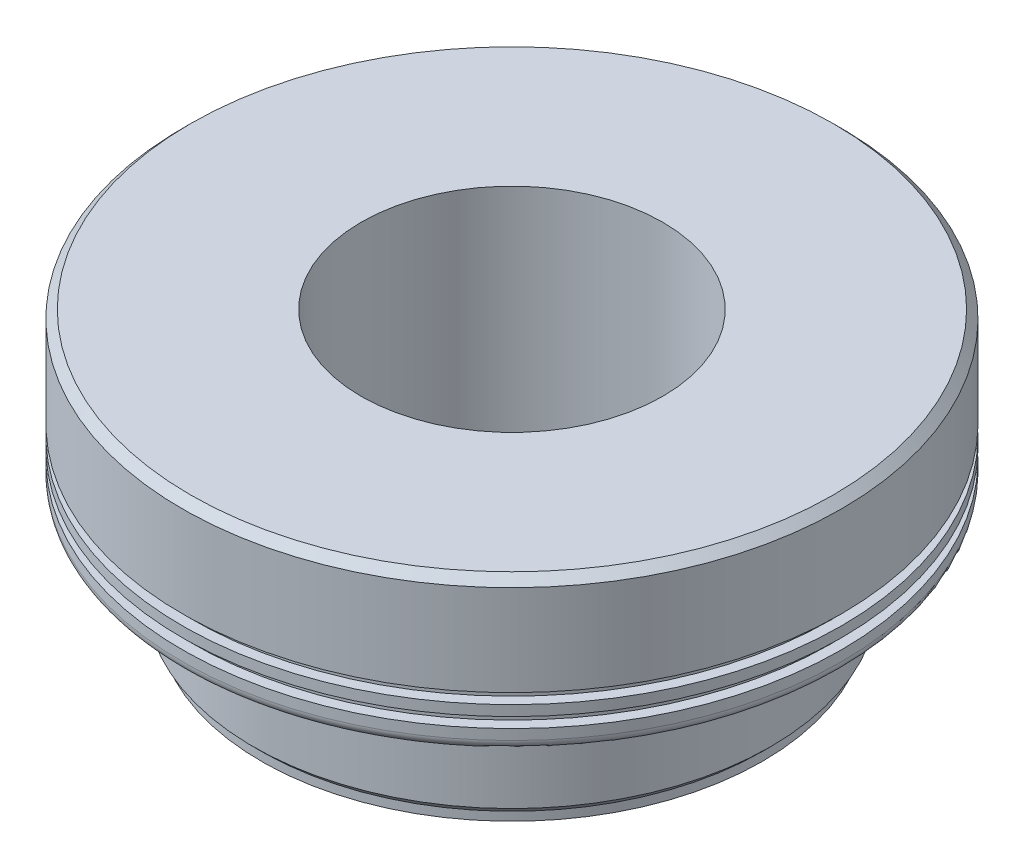
ISO-10303-21;
HEADER;
FILE_DESCRIPTION(('STEP AP214'),'2;1');
FILE_NAME('part.step','',(''),(''),'','','');
FILE_SCHEMA(('AUTOMOTIVE_DESIGN { 1 0 10303 214 1 1 1 1 }'));
ENDSEC;
DATA;
#1=APPLICATION_CONTEXT('core data for automotive mechanical design processes');
#2=APPLICATION_PROTOCOL_DEFINITION('international standard','automotive_design',2000,#1);
#3=PRODUCT_CONTEXT('',#1,'mechanical');
#4=PRODUCT('Part','Part','',(#3));
#5=PRODUCT_RELATED_PRODUCT_CATEGORY('part','',(#4));
#6=PRODUCT_DEFINITION_FORMATION('','',#4);
#7=PRODUCT_DEFINITION_CONTEXT('part definition',#1,'design');
#8=PRODUCT_DEFINITION('design','',#6,#7);
#9=PRODUCT_DEFINITION_SHAPE('','',#8);
#10=(LENGTH_UNIT() NAMED_UNIT(*) SI_UNIT(.MILLI.,.METRE.));
#11=(NAMED_UNIT(*) PLANE_ANGLE_UNIT() SI_UNIT($,.RADIAN.));
#12=(NAMED_UNIT(*) SI_UNIT($,.STERADIAN.) SOLID_ANGLE_UNIT());
#13=UNCERTAINTY_MEASURE_WITH_UNIT(LENGTH_MEASURE(1.E-05),#10,'distance_accuracy_value','');
#14=(GEOMETRIC_REPRESENTATION_CONTEXT(3) GLOBAL_UNCERTAINTY_ASSIGNED_CONTEXT((#13)) GLOBAL_UNIT_ASSIGNED_CONTEXT((#10,
#11,#12)) REPRESENTATION_CONTEXT('',''));
#15=CARTESIAN_POINT('',(0.,0.,0.));
#16=DIRECTION('',(0.,0.,1.));
#17=DIRECTION('',(1.,0.,0.));
#18=AXIS2_PLACEMENT_3D('',#15,#16,#17);
#19=CARTESIAN_POINT('',(-2.,1.765,0.));
#20=DIRECTION('',(0.,-1.,0.));
#21=DIRECTION('',(1.,0.,0.));
#22=AXIS2_PLACEMENT_3D('',#19,#20,#21);
#23=PLANE('',#22);
#24=CARTESIAN_POINT('',(0.,1.765,0.));
#25=DIRECTION('',(0.,-1.,0.));
#26=DIRECTION('',(1.,0.,0.));
#27=AXIS2_PLACEMENT_3D('',#24,#25,#26);
#28=CIRCLE('',#27,4.2629);
#29=CARTESIAN_POINT('',(4.2629,1.765,0.));
#30=VERTEX_POINT('',#29);
#31=EDGE_CURVE('E134',#30,#30,#28,.T.);
#32=ORIENTED_EDGE('',*,*,#31,.F.);
#33=EDGE_LOOP('',(#32));
#34=FACE_BOUND('',#33,.T.);
#35=CARTESIAN_POINT('',(0.,1.765,0.));
#36=DIRECTION('',(0.,-1.,0.));
#37=DIRECTION('',(1.,0.,0.));
#38=AXIS2_PLACEMENT_3D('',#35,#36,#37);
#39=CIRCLE('',#38,2.);
#40=CARTESIAN_POINT('',(2.,1.765,0.));
#41=VERTEX_POINT('',#40);
#42=EDGE_CURVE('E10',#41,#41,#39,.T.);
#43=ORIENTED_EDGE('',*,*,#42,.T.);
#44=EDGE_LOOP('',(#43));
#45=FACE_BOUND('',#44,.T.);
#46=ADVANCED_FACE('F39',(#34,#45),#23,.F.);
#47=CARTESIAN_POINT('',(0.,-1.765,0.));
#48=DIRECTION('',(0.,-1.,0.));
#49=DIRECTION('',(1.,0.,0.));
#50=AXIS2_PLACEMENT_3D('',#47,#48,#49);
#51=CYLINDRICAL_SURFACE('',#50,2.);
#52=ORIENTED_EDGE('',*,*,#42,.F.);
#53=EDGE_LOOP('',(#52));
#54=FACE_BOUND('',#53,.T.);
#55=CARTESIAN_POINT('',(0.,-1.765,0.));
#56=DIRECTION('',(0.,-1.,0.));
#57=DIRECTION('',(1.,0.,0.));
#58=AXIS2_PLACEMENT_3D('',#55,#56,#57);
#59=CIRCLE('',#58,2.);
#60=CARTESIAN_POINT('',(2.,-1.765,0.));
#61=VERTEX_POINT('',#60);
#62=EDGE_CURVE('E46',#61,#61,#59,.T.);
#63=ORIENTED_EDGE('',*,*,#62,.T.);
#64=EDGE_LOOP('',(#63));
#65=FACE_BOUND('',#64,.T.);
#66=ADVANCED_FACE('F142',(#54,#65),#51,.F.);
#67=CARTESIAN_POINT('',(-3.3229,-1.765,0.));
#68=DIRECTION('',(0.,1.,0.));
#69=DIRECTION('',(-1.,0.,0.));
#70=AXIS2_PLACEMENT_3D('',#67,#68,#69);
#71=PLANE('',#70);
#72=ORIENTED_EDGE('',*,*,#62,.F.);
#73=EDGE_LOOP('',(#72));
#74=FACE_BOUND('',#73,.T.);
#75=CARTESIAN_POINT('',(0.,-1.765,0.));
#76=DIRECTION('',(0.,-1.,0.));
#77=DIRECTION('',(1.,0.,0.));
#78=AXIS2_PLACEMENT_3D('',#75,#76,#77);
#79=CIRCLE('',#78,3.3229);
#80=CARTESIAN_POINT('',(3.3229,-1.765,0.));
#81=VERTEX_POINT('',#80);
#82=EDGE_CURVE('E51',#81,#81,#79,.T.);
#83=ORIENTED_EDGE('',*,*,#82,.T.);
#84=EDGE_LOOP('',(#83));
#85=FACE_BOUND('',#84,.T.);
#86=ADVANCED_FACE('F146',(#74,#85),#71,.F.);
#87=CARTESIAN_POINT('',(0.,-1.765,0.));
#88=DIRECTION('',(0.,-1.,0.));
#89=DIRECTION('',(1.,0.,0.));
#90=AXIS2_PLACEMENT_3D('',#87,#88,#89);
#91=CYLINDRICAL_SURFACE('',#90,3.3229);
#92=ORIENTED_EDGE('',*,*,#82,.F.);
#93=EDGE_LOOP('',(#92));
#94=FACE_BOUND('',#93,.T.);
#95=CARTESIAN_POINT('',(0.,-1.65025,0.));
#96=DIRECTION('',(0.,-1.,0.));
#97=DIRECTION('',(1.,0.,0.));
#98=AXIS2_PLACEMENT_3D('',#95,#96,#97);
#99=CIRCLE('',#98,3.3229);
#100=CARTESIAN_POINT('',(3.3229,-1.65025,0.));
#101=VERTEX_POINT('',#100);
#102=EDGE_CURVE('E56',#101,#101,#99,.T.);
#103=ORIENTED_EDGE('',*,*,#102,.T.);
#104=EDGE_LOOP('',(#103));
#105=FACE_BOUND('',#104,.T.);
#106=ADVANCED_FACE('F151',(#94,#105),#91,.T.);
#107=CARTESIAN_POINT('',(0.,-1.54315,0.));
#108=DIRECTION('',(0.,1.,0.));
#109=DIRECTION('',(-1.,0.,0.));
#110=AXIS2_PLACEMENT_3D('',#107,#108,#109);
#111=CONICAL_SURFACE('',#110,3.43,0.785398163397456);
#112=ORIENTED_EDGE('',*,*,#102,.F.);
#113=EDGE_LOOP('',(#112));
#114=FACE_BOUND('',#113,.T.);
#115=CARTESIAN_POINT('',(0.,-1.54315,0.));
#116=DIRECTION('',(0.,-1.,0.));
#117=DIRECTION('',(1.,0.,0.));
#118=AXIS2_PLACEMENT_3D('',#115,#116,#117);
#119=CIRCLE('',#118,3.43);
#120=CARTESIAN_POINT('',(3.43,-1.54315,0.));
#121=VERTEX_POINT('',#120);
#122=EDGE_CURVE('E62',#121,#121,#119,.T.);
#123=ORIENTED_EDGE('',*,*,#122,.T.);
#124=EDGE_LOOP('',(#123));
#125=FACE_BOUND('',#124,.T.);
#126=ADVANCED_FACE('F157',(#114,#125),#111,.T.);
#127=CARTESIAN_POINT('',(0.,-1.765,0.));
#128=DIRECTION('',(0.,-1.,0.));
#129=DIRECTION('',(1.,0.,0.));
#130=AXIS2_PLACEMENT_3D('',#127,#128,#129);
#131=CYLINDRICAL_SURFACE('',#130,3.43);
#132=ORIENTED_EDGE('',*,*,#122,.F.);
#133=EDGE_LOOP('',(#132));
#134=FACE_BOUND('',#133,.T.);
#135=CARTESIAN_POINT('',(0.,-0.628975,0.));
#136=DIRECTION('',(0.,-1.,0.));
#137=DIRECTION('',(1.,0.,0.));
#138=AXIS2_PLACEMENT_3D('',#135,#136,#137);
#139=CIRCLE('',#138,3.43);
#140=CARTESIAN_POINT('',(3.43,-0.628975,0.));
#141=VERTEX_POINT('',#140);
#142=EDGE_CURVE('E66',#141,#141,#139,.T.);
#143=ORIENTED_EDGE('',*,*,#142,.T.);
#144=EDGE_LOOP('',(#143));
#145=FACE_BOUND('',#144,.T.);
#146=ADVANCED_FACE('F161',(#134,#145),#131,.T.);
#147=CARTESIAN_POINT('',(0.,-0.521875,0.));
#148=DIRECTION('',(0.,-1.,0.));
#149=DIRECTION('',(1.,0.,0.));
#150=AXIS2_PLACEMENT_3D('',#147,#148,#149);
#151=CONICAL_SURFACE('',#150,3.3229,0.785398163397439);
#152=ORIENTED_EDGE('',*,*,#142,.F.);
#153=EDGE_LOOP('',(#152));
#154=FACE_BOUND('',#153,.T.);
#155=CARTESIAN_POINT('',(0.,-0.521875,0.));
#156=DIRECTION('',(0.,-1.,0.));
#157=DIRECTION('',(1.,0.,0.));
#158=AXIS2_PLACEMENT_3D('',#155,#156,#157);
#159=CIRCLE('',#158,3.3229);
#160=CARTESIAN_POINT('',(3.3229,-0.521874999999999,0.));
#161=VERTEX_POINT('',#160);
#162=EDGE_CURVE('E70',#161,#161,#159,.T.);
#163=ORIENTED_EDGE('',*,*,#162,.T.);
#164=EDGE_LOOP('',(#163));
#165=FACE_BOUND('',#164,.T.);
#166=ADVANCED_FACE('F165',(#154,#165),#151,.T.);
#167=CARTESIAN_POINT('',(-3.3229,-0.521875,0.));
#168=DIRECTION('',(0.,-1.,0.));
#169=DIRECTION('',(1.,0.,0.));
#170=AXIS2_PLACEMENT_3D('',#167,#168,#169);
#171=PLANE('',#170);
#172=ORIENTED_EDGE('',*,*,#162,.F.);
#173=EDGE_LOOP('',(#172));
#174=FACE_BOUND('',#173,.T.);
#175=CARTESIAN_POINT('',(0.,-0.521875,0.));
#176=DIRECTION('',(0.,-1.,0.));
#177=DIRECTION('',(1.,0.,0.));
#178=AXIS2_PLACEMENT_3D('',#175,#176,#177);
#179=CIRCLE('',#178,3.307578125);
#180=CARTESIAN_POINT('',(3.307578125,-0.521874999999999,0.));
#181=VERTEX_POINT('',#180);
#182=EDGE_CURVE('E74',#181,#181,#179,.T.);
#183=ORIENTED_EDGE('',*,*,#182,.T.);
#184=EDGE_LOOP('',(#183));
#185=FACE_BOUND('',#184,.T.);
#186=ADVANCED_FACE('F169',(#174,#185),#171,.F.);
#187=CARTESIAN_POINT('',(0.,-0.414296875,0.));
#188=DIRECTION('',(0.,-1.,0.));
#189=DIRECTION('',(1.,0.,0.));
#190=AXIS2_PLACEMENT_3D('',#187,#188,#189);
#191=TOROIDAL_SURFACE('',#190,3.307578125,0.107578125);
#192=ORIENTED_EDGE('',*,*,#182,.F.);
#193=EDGE_LOOP('',(#192));
#194=FACE_BOUND('',#193,.T.);
#195=CARTESIAN_POINT('',(0.,-0.414296875,0.));
#196=DIRECTION('',(0.,-1.,0.));
#197=DIRECTION('',(1.,0.,0.));
#198=AXIS2_PLACEMENT_3D('',#195,#196,#197);
#199=CIRCLE('',#198,3.2);
#200=CARTESIAN_POINT('',(3.2,-0.414296874999999,0.));
#201=VERTEX_POINT('',#200);
#202=EDGE_CURVE('E78',#201,#201,#199,.T.);
#203=ORIENTED_EDGE('',*,*,#202,.T.);
#204=EDGE_LOOP('',(#203));
#205=FACE_BOUND('',#204,.T.);
#206=ADVANCED_FACE('F173',(#194,#205),#191,.F.);
#207=CARTESIAN_POINT('',(0.,-1.765,0.));
#208=DIRECTION('',(0.,-1.,0.));
#209=DIRECTION('',(1.,0.,0.));
#210=AXIS2_PLACEMENT_3D('',#207,#208,#209);
#211=CYLINDRICAL_SURFACE('',#210,3.2);
#212=ORIENTED_EDGE('',*,*,#202,.F.);
#213=EDGE_LOOP('',(#212));
#214=FACE_BOUND('',#213,.T.);
#215=CARTESIAN_POINT('',(0.,-0.342578125,0.));
#216=DIRECTION('',(0.,-1.,0.));
#217=DIRECTION('',(1.,0.,0.));
#218=AXIS2_PLACEMENT_3D('',#215,#216,#217);
#219=CIRCLE('',#218,3.2);
#220=CARTESIAN_POINT('',(3.2,-0.342578124999999,0.));
#221=VERTEX_POINT('',#220);
#222=EDGE_CURVE('E82',#221,#221,#219,.T.);
#223=ORIENTED_EDGE('',*,*,#222,.T.);
#224=EDGE_LOOP('',(#223));
#225=FACE_BOUND('',#224,.T.);
#226=ADVANCED_FACE('F177',(#214,#225),#211,.T.);
#227=CARTESIAN_POINT('',(0.,-0.342578125,0.));
#228=DIRECTION('',(0.,-1.,0.));
#229=DIRECTION('',(1.,0.,0.));
#230=AXIS2_PLACEMENT_3D('',#227,#228,#229);
#231=TOROIDAL_SURFACE('',#230,3.307578125,0.107578125);
#232=ORIENTED_EDGE('',*,*,#222,.F.);
#233=EDGE_LOOP('',(#232));
#234=FACE_BOUND('',#233,.T.);
#235=CARTESIAN_POINT('',(0.,-0.234999999999999,0.));
#236=DIRECTION('',(0.,-1.,0.));
#237=DIRECTION('',(1.,0.,0.));
#238=AXIS2_PLACEMENT_3D('',#235,#236,#237);
#239=CIRCLE('',#238,3.307578125);
#240=CARTESIAN_POINT('',(3.307578125,-0.234999999999999,0.));
#241=VERTEX_POINT('',#240);
#242=EDGE_CURVE('E86',#241,#241,#239,.T.);
#243=ORIENTED_EDGE('',*,*,#242,.T.);
#244=EDGE_LOOP('',(#243));
#245=FACE_BOUND('',#244,.T.);
#246=ADVANCED_FACE('F181',(#234,#245),#231,.F.);
#247=CARTESIAN_POINT('',(-3.307578125,-0.235,0.));
#248=DIRECTION('',(0.,1.,0.));
#249=DIRECTION('',(-1.,0.,0.));
#250=AXIS2_PLACEMENT_3D('',#247,#248,#249);
#251=PLANE('',#250);
#252=ORIENTED_EDGE('',*,*,#242,.F.);
#253=EDGE_LOOP('',(#252));
#254=FACE_BOUND('',#253,.T.);
#255=CARTESIAN_POINT('',(0.,-0.235,0.));
#256=DIRECTION('',(0.,-1.,0.));
#257=DIRECTION('',(1.,0.,0.));
#258=AXIS2_PLACEMENT_3D('',#255,#256,#257);
#259=CIRCLE('',#258,4.2325);
#260=CARTESIAN_POINT('',(4.2325,-0.234999999999999,0.));
#261=VERTEX_POINT('',#260);
#262=EDGE_CURVE('E90',#261,#261,#259,.T.);
#263=ORIENTED_EDGE('',*,*,#262,.T.);
#264=EDGE_LOOP('',(#263));
#265=FACE_BOUND('',#264,.T.);
#266=ADVANCED_FACE('F185',(#254,#265),#251,.F.);
#267=CARTESIAN_POINT('',(0.,-0.0974999999999997,0.));
#268=DIRECTION('',(0.,-1.,0.));
#269=DIRECTION('',(1.,0.,0.));
#270=AXIS2_PLACEMENT_3D('',#267,#268,#269);
#271=TOROIDAL_SURFACE('',#270,4.2325,0.1375);
#272=ORIENTED_EDGE('',*,*,#262,.F.);
#273=EDGE_LOOP('',(#272));
#274=FACE_BOUND('',#273,.T.);
#275=CARTESIAN_POINT('',(0.,-0.0974999999999997,0.));
#276=DIRECTION('',(0.,-1.,0.));
#277=DIRECTION('',(1.,0.,0.));
#278=AXIS2_PLACEMENT_3D('',#275,#276,#277);
#279=CIRCLE('',#278,4.37);
#280=CARTESIAN_POINT('',(4.37,-0.0974999999999992,0.));
#281=VERTEX_POINT('',#280);
#282=EDGE_CURVE('E94',#281,#281,#279,.T.);
#283=ORIENTED_EDGE('',*,*,#282,.T.);
#284=EDGE_LOOP('',(#283));
#285=FACE_BOUND('',#284,.T.);
#286=ADVANCED_FACE('F189',(#274,#285),#271,.T.);
#287=CARTESIAN_POINT('',(0.,-1.765,0.));
#288=DIRECTION('',(0.,-1.,0.));
#289=DIRECTION('',(1.,0.,0.));
#290=AXIS2_PLACEMENT_3D('',#287,#288,#289);
#291=CYLINDRICAL_SURFACE('',#290,4.37);
#292=ORIENTED_EDGE('',*,*,#282,.F.);
#293=EDGE_LOOP('',(#292));
#294=FACE_BOUND('',#293,.T.);
#295=CARTESIAN_POINT('',(0.,0.0400000000000003,0.));
#296=DIRECTION('',(0.,-1.,0.));
#297=DIRECTION('',(1.,0.,0.));
#298=AXIS2_PLACEMENT_3D('',#295,#296,#297);
#299=CIRCLE('',#298,4.37);
#300=CARTESIAN_POINT('',(4.37,0.0400000000000009,0.));
#301=VERTEX_POINT('',#300);
#302=EDGE_CURVE('E98',#301,#301,#299,.T.);
#303=ORIENTED_EDGE('',*,*,#302,.T.);
#304=EDGE_LOOP('',(#303));
#305=FACE_BOUND('',#304,.T.);
#306=ADVANCED_FACE('F193',(#294,#305),#291,.T.);
#307=CARTESIAN_POINT('',(-4.37,0.0399999999999999,0.));
#308=DIRECTION('',(0.,-1.,0.));
#309=DIRECTION('',(1.,0.,0.));
#310=AXIS2_PLACEMENT_3D('',#307,#308,#309);
#311=PLANE('',#310);
#312=ORIENTED_EDGE('',*,*,#302,.F.);
#313=EDGE_LOOP('',(#312));
#314=FACE_BOUND('',#313,.T.);
#315=CARTESIAN_POINT('',(0.,0.0400000000000003,0.));
#316=DIRECTION('',(0.,-1.,0.));
#317=DIRECTION('',(1.,0.,0.));
#318=AXIS2_PLACEMENT_3D('',#315,#316,#317);
#319=CIRCLE('',#318,4.2325);
#320=CARTESIAN_POINT('',(4.2325,0.0400000000000008,0.));
#321=VERTEX_POINT('',#320);
#322=EDGE_CURVE('E102',#321,#321,#319,.T.);
#323=ORIENTED_EDGE('',*,*,#322,.T.);
#324=EDGE_LOOP('',(#323));
#325=FACE_BOUND('',#324,.T.);
#326=ADVANCED_FACE('F197',(#314,#325),#311,.F.);
#327=CARTESIAN_POINT('',(0.,-1.765,0.));
#328=DIRECTION('',(0.,-1.,0.));
#329=DIRECTION('',(1.,0.,0.));
#330=AXIS2_PLACEMENT_3D('',#327,#328,#329);
#331=CYLINDRICAL_SURFACE('',#330,4.2325);
#332=ORIENTED_EDGE('',*,*,#322,.F.);
#333=EDGE_LOOP('',(#332));
#334=FACE_BOUND('',#333,.T.);
#335=CARTESIAN_POINT('',(0.,0.1775,0.));
#336=DIRECTION('',(0.,-1.,0.));
#337=DIRECTION('',(1.,0.,0.));
#338=AXIS2_PLACEMENT_3D('',#335,#336,#337);
#339=CIRCLE('',#338,4.2325);
#340=CARTESIAN_POINT('',(4.2325,0.177500000000001,0.));
#341=VERTEX_POINT('',#340);
#342=EDGE_CURVE('E106',#341,#341,#339,.T.);
#343=ORIENTED_EDGE('',*,*,#342,.T.);
#344=EDGE_LOOP('',(#343));
#345=FACE_BOUND('',#344,.T.);
#346=ADVANCED_FACE('F201',(#334,#345),#331,.T.);
#347=CARTESIAN_POINT('',(-4.2325,0.1775,0.));
#348=DIRECTION('',(0.,1.,0.));
#349=DIRECTION('',(-1.,0.,0.));
#350=AXIS2_PLACEMENT_3D('',#347,#348,#349);
#351=PLANE('',#350);
#352=ORIENTED_EDGE('',*,*,#342,.F.);
#353=EDGE_LOOP('',(#352));
#354=FACE_BOUND('',#353,.T.);
#355=CARTESIAN_POINT('',(0.,0.1775,0.));
#356=DIRECTION('',(0.,-1.,0.));
#357=DIRECTION('',(1.,0.,0.));
#358=AXIS2_PLACEMENT_3D('',#355,#356,#357);
#359=CIRCLE('',#358,4.37);
#360=CARTESIAN_POINT('',(4.37,0.177500000000001,0.));
#361=VERTEX_POINT('',#360);
#362=EDGE_CURVE('E110',#361,#361,#359,.T.);
#363=ORIENTED_EDGE('',*,*,#362,.T.);
#364=EDGE_LOOP('',(#363));
#365=FACE_BOUND('',#364,.T.);
#366=ADVANCED_FACE('F205',(#354,#365),#351,.F.);
#367=CARTESIAN_POINT('',(0.,-1.765,0.));
#368=DIRECTION('',(0.,-1.,0.));
#369=DIRECTION('',(1.,0.,0.));
#370=AXIS2_PLACEMENT_3D('',#367,#368,#369);
#371=CYLINDRICAL_SURFACE('',#370,4.37);
#372=ORIENTED_EDGE('',*,*,#362,.F.);
#373=EDGE_LOOP('',(#372));
#374=FACE_BOUND('',#373,.T.);
#375=CARTESIAN_POINT('',(0.,0.315000000000001,0.));
#376=DIRECTION('',(0.,-1.,0.));
#377=DIRECTION('',(1.,0.,0.));
#378=AXIS2_PLACEMENT_3D('',#375,#376,#377);
#379=CIRCLE('',#378,4.37);
#380=CARTESIAN_POINT('',(4.37,0.315000000000001,0.));
#381=VERTEX_POINT('',#380);
#382=EDGE_CURVE('E114',#381,#381,#379,.T.);
#383=ORIENTED_EDGE('',*,*,#382,.T.);
#384=EDGE_LOOP('',(#383));
#385=FACE_BOUND('',#384,.T.);
#386=ADVANCED_FACE('F209',(#374,#385),#371,.T.);
#387=CARTESIAN_POINT('',(-4.37,0.315,0.));
#388=DIRECTION('',(0.,-1.,0.));
#389=DIRECTION('',(1.,0.,0.));
#390=AXIS2_PLACEMENT_3D('',#387,#388,#389);
#391=PLANE('',#390);
#392=ORIENTED_EDGE('',*,*,#382,.F.);
#393=EDGE_LOOP('',(#392));
#394=FACE_BOUND('',#393,.T.);
#395=CARTESIAN_POINT('',(0.,0.315000000000001,0.));
#396=DIRECTION('',(0.,-1.,0.));
#397=DIRECTION('',(1.,0.,0.));
#398=AXIS2_PLACEMENT_3D('',#395,#396,#397);
#399=CIRCLE('',#398,4.2325);
#400=CARTESIAN_POINT('',(4.2325,0.315000000000001,0.));
#401=VERTEX_POINT('',#400);
#402=EDGE_CURVE('E118',#401,#401,#399,.T.);
#403=ORIENTED_EDGE('',*,*,#402,.T.);
#404=EDGE_LOOP('',(#403));
#405=FACE_BOUND('',#404,.T.);
#406=ADVANCED_FACE('F213',(#394,#405),#391,.F.);
#407=CARTESIAN_POINT('',(0.,-1.765,0.));
#408=DIRECTION('',(0.,-1.,0.));
#409=DIRECTION('',(1.,0.,0.));
#410=AXIS2_PLACEMENT_3D('',#407,#408,#409);
#411=CYLINDRICAL_SURFACE('',#410,4.2325);
#412=ORIENTED_EDGE('',*,*,#402,.F.);
#413=EDGE_LOOP('',(#412));
#414=FACE_BOUND('',#413,.T.);
#415=CARTESIAN_POINT('',(0.,0.4525,0.));
#416=DIRECTION('',(0.,-1.,0.));
#417=DIRECTION('',(1.,0.,0.));
#418=AXIS2_PLACEMENT_3D('',#415,#416,#417);
#419=CIRCLE('',#418,4.2325);
#420=CARTESIAN_POINT('',(4.2325,0.452500000000001,0.));
#421=VERTEX_POINT('',#420);
#422=EDGE_CURVE('E122',#421,#421,#419,.T.);
#423=ORIENTED_EDGE('',*,*,#422,.T.);
#424=EDGE_LOOP('',(#423));
#425=FACE_BOUND('',#424,.T.);
#426=ADVANCED_FACE('F217',(#414,#425),#411,.T.);
#427=CARTESIAN_POINT('',(-4.2325,0.4525,0.));
#428=DIRECTION('',(0.,1.,0.));
#429=DIRECTION('',(-1.,0.,0.));
#430=AXIS2_PLACEMENT_3D('',#427,#428,#429);
#431=PLANE('',#430);
#432=ORIENTED_EDGE('',*,*,#422,.F.);
#433=EDGE_LOOP('',(#432));
#434=FACE_BOUND('',#433,.T.);
#435=CARTESIAN_POINT('',(0.,0.4525,0.));
#436=DIRECTION('',(0.,-1.,0.));
#437=DIRECTION('',(1.,0.,0.));
#438=AXIS2_PLACEMENT_3D('',#435,#436,#437);
#439=CIRCLE('',#438,4.37);
#440=CARTESIAN_POINT('',(4.37,0.452500000000001,0.));
#441=VERTEX_POINT('',#440);
#442=EDGE_CURVE('E126',#441,#441,#439,.T.);
#443=ORIENTED_EDGE('',*,*,#442,.T.);
#444=EDGE_LOOP('',(#443));
#445=FACE_BOUND('',#444,.T.);
#446=ADVANCED_FACE('F221',(#434,#445),#431,.F.);
#447=CARTESIAN_POINT('',(0.,-1.765,0.));
#448=DIRECTION('',(0.,-1.,0.));
#449=DIRECTION('',(1.,0.,0.));
#450=AXIS2_PLACEMENT_3D('',#447,#448,#449);
#451=CYLINDRICAL_SURFACE('',#450,4.37);
#452=ORIENTED_EDGE('',*,*,#442,.F.);
#453=EDGE_LOOP('',(#452));
#454=FACE_BOUND('',#453,.T.);
#455=CARTESIAN_POINT('',(0.,1.6579,0.));
#456=DIRECTION('',(0.,-1.,0.));
#457=DIRECTION('',(1.,0.,0.));
#458=AXIS2_PLACEMENT_3D('',#455,#456,#457);
#459=CIRCLE('',#458,4.37);
#460=CARTESIAN_POINT('',(4.37,1.6579,0.));
#461=VERTEX_POINT('',#460);
#462=EDGE_CURVE('E130',#461,#461,#459,.T.);
#463=ORIENTED_EDGE('',*,*,#462,.T.);
#464=EDGE_LOOP('',(#463));
#465=FACE_BOUND('',#464,.T.);
#466=ADVANCED_FACE('F225',(#454,#465),#451,.T.);
#467=CARTESIAN_POINT('',(0.,1.765,0.));
#468=DIRECTION('',(0.,-1.,0.));
#469=DIRECTION('',(1.,0.,0.));
#470=AXIS2_PLACEMENT_3D('',#467,#468,#469);
#471=CONICAL_SURFACE('',#470,4.2629,0.785398163397454);
#472=ORIENTED_EDGE('',*,*,#462,.F.);
#473=EDGE_LOOP('',(#472));
#474=FACE_BOUND('',#473,.T.);
#475=ORIENTED_EDGE('',*,*,#31,.T.);
#476=EDGE_LOOP('',(#475));
#477=FACE_BOUND('',#476,.T.);
#478=ADVANCED_FACE('F139',(#474,#477),#471,.T.);
#479=CLOSED_SHELL('',(#46,#66,#86,#106,#126,#146,#166,#186,#206,#226,#246,#266,#286,#306,#326,
#346,#366,#386,#406,#426,#446,#466,#478));
#480=MANIFOLD_SOLID_BREP('B2',#479);
#481=ADVANCED_BREP_SHAPE_REPRESENTATION('',(#18,#480),#14);
#482=SHAPE_DEFINITION_REPRESENTATION(#9,#481);
ENDSEC;
END-ISO-10303-21;
